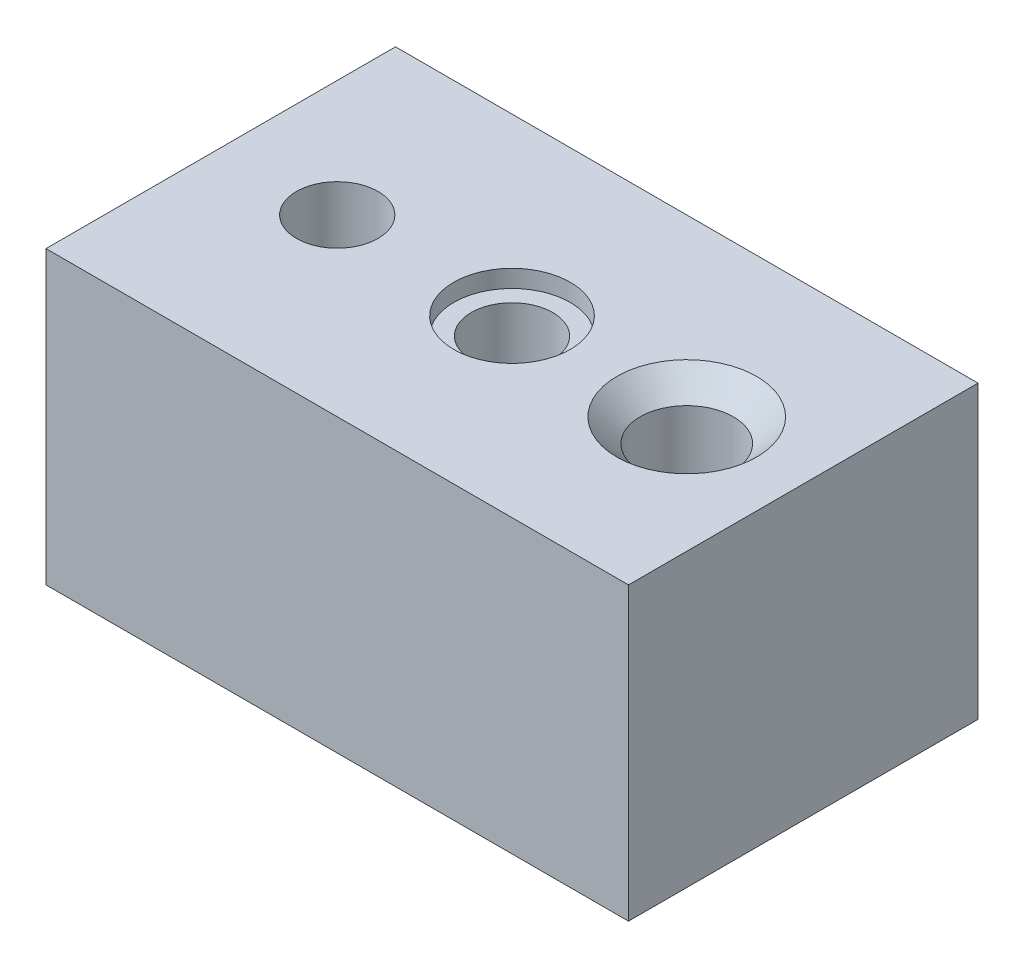
ISO-10303-21;
HEADER;
FILE_DESCRIPTION(('STEP AP214'),'2;1');
FILE_NAME('part.step','',(''),(''),'','','');
FILE_SCHEMA(('AUTOMOTIVE_DESIGN { 1 0 10303 214 1 1 1 1 }'));
ENDSEC;
DATA;
#1=APPLICATION_CONTEXT('core data for automotive mechanical design processes');
#2=APPLICATION_PROTOCOL_DEFINITION('international standard','automotive_design',2000,#1);
#3=PRODUCT_CONTEXT('',#1,'mechanical');
#4=PRODUCT('Part','Part','',(#3));
#5=PRODUCT_RELATED_PRODUCT_CATEGORY('part','',(#4));
#6=PRODUCT_DEFINITION_FORMATION('','',#4);
#7=PRODUCT_DEFINITION_CONTEXT('part definition',#1,'design');
#8=PRODUCT_DEFINITION('design','',#6,#7);
#9=PRODUCT_DEFINITION_SHAPE('','',#8);
#10=(LENGTH_UNIT() NAMED_UNIT(*) SI_UNIT(.MILLI.,.METRE.));
#11=(NAMED_UNIT(*) PLANE_ANGLE_UNIT() SI_UNIT($,.RADIAN.));
#12=(NAMED_UNIT(*) SI_UNIT($,.STERADIAN.) SOLID_ANGLE_UNIT());
#13=UNCERTAINTY_MEASURE_WITH_UNIT(LENGTH_MEASURE(1.E-05),#10,'distance_accuracy_value','');
#14=(GEOMETRIC_REPRESENTATION_CONTEXT(3) GLOBAL_UNCERTAINTY_ASSIGNED_CONTEXT((#13)) GLOBAL_UNIT_ASSIGNED_CONTEXT((#10,
#11,#12)) REPRESENTATION_CONTEXT('',''));
#15=CARTESIAN_POINT('',(0.,0.,0.));
#16=DIRECTION('',(0.,0.,1.));
#17=DIRECTION('',(1.,0.,0.));
#18=AXIS2_PLACEMENT_3D('',#15,#16,#17);
#19=CARTESIAN_POINT('',(0.,50.,0.));
#20=DIRECTION('',(1.,0.,0.));
#21=DIRECTION('',(0.,0.,-1.));
#22=AXIS2_PLACEMENT_3D('',#19,#20,#21);
#23=PLANE('',#22);
#24=DIRECTION('',(0.,0.,1.));
#25=VECTOR('',#24,1.);
#26=CARTESIAN_POINT('',(0.,0.,0.));
#27=LINE('',#26,#25);
#28=CARTESIAN_POINT('',(0.,0.,-60.));
#29=VERTEX_POINT('',#28);
#30=CARTESIAN_POINT('',(0.,0.,0.));
#31=VERTEX_POINT('',#30);
#32=EDGE_CURVE('E143',#29,#31,#27,.T.);
#33=ORIENTED_EDGE('',*,*,#32,.T.);
#34=DIRECTION('',(0.,-1.,0.));
#35=VECTOR('',#34,1.);
#36=CARTESIAN_POINT('',(0.,50.,0.));
#37=LINE('',#36,#35);
#38=CARTESIAN_POINT('',(0.,50.,0.));
#39=VERTEX_POINT('',#38);
#40=EDGE_CURVE('E11',#39,#31,#37,.T.);
#41=ORIENTED_EDGE('',*,*,#40,.F.);
#42=DIRECTION('',(0.,0.,1.));
#43=VECTOR('',#42,1.);
#44=CARTESIAN_POINT('',(0.,50.,0.));
#45=LINE('',#44,#43);
#46=CARTESIAN_POINT('',(0.,50.,-60.));
#47=VERTEX_POINT('',#46);
#48=EDGE_CURVE('E144',#47,#39,#45,.T.);
#49=ORIENTED_EDGE('',*,*,#48,.F.);
#50=DIRECTION('',(0.,-1.,0.));
#51=VECTOR('',#50,1.);
#52=CARTESIAN_POINT('',(0.,50.,-60.));
#53=LINE('',#52,#51);
#54=EDGE_CURVE('E154',#47,#29,#53,.T.);
#55=ORIENTED_EDGE('',*,*,#54,.T.);
#56=EDGE_LOOP('',(#33,#41,#49,#55));
#57=FACE_BOUND('',#56,.T.);
#58=ADVANCED_FACE('F51',(#57),#23,.F.);
#59=CARTESIAN_POINT('',(0.,50.,0.));
#60=DIRECTION('',(0.,0.,-1.));
#61=DIRECTION('',(-1.,0.,0.));
#62=AXIS2_PLACEMENT_3D('',#59,#60,#61);
#63=PLANE('',#62);
#64=DIRECTION('',(1.,0.,0.));
#65=VECTOR('',#64,1.);
#66=CARTESIAN_POINT('',(0.,0.,0.));
#67=LINE('',#66,#65);
#68=CARTESIAN_POINT('',(100.,0.,0.));
#69=VERTEX_POINT('',#68);
#70=EDGE_CURVE('E158',#31,#69,#67,.T.);
#71=ORIENTED_EDGE('',*,*,#70,.T.);
#72=DIRECTION('',(0.,-1.,0.));
#73=VECTOR('',#72,1.);
#74=CARTESIAN_POINT('',(100.,50.,0.));
#75=LINE('',#74,#73);
#76=CARTESIAN_POINT('',(100.,50.,0.));
#77=VERTEX_POINT('',#76);
#78=EDGE_CURVE('E60',#77,#69,#75,.T.);
#79=ORIENTED_EDGE('',*,*,#78,.F.);
#80=DIRECTION('',(1.,0.,0.));
#81=VECTOR('',#80,1.);
#82=CARTESIAN_POINT('',(0.,50.,0.));
#83=LINE('',#82,#81);
#84=EDGE_CURVE('E99',#39,#77,#83,.T.);
#85=ORIENTED_EDGE('',*,*,#84,.F.);
#86=ORIENTED_EDGE('',*,*,#40,.T.);
#87=EDGE_LOOP('',(#71,#79,#85,#86));
#88=FACE_BOUND('',#87,.T.);
#89=ADVANCED_FACE('F190',(#88),#63,.F.);
#90=CARTESIAN_POINT('',(100.,50.,0.));
#91=DIRECTION('',(-1.,0.,0.));
#92=DIRECTION('',(0.,0.,1.));
#93=AXIS2_PLACEMENT_3D('',#90,#91,#92);
#94=PLANE('',#93);
#95=DIRECTION('',(0.,0.,-1.));
#96=VECTOR('',#95,1.);
#97=CARTESIAN_POINT('',(100.,0.,0.));
#98=LINE('',#97,#96);
#99=CARTESIAN_POINT('',(100.,0.,-60.));
#100=VERTEX_POINT('',#99);
#101=EDGE_CURVE('E86',#69,#100,#98,.T.);
#102=ORIENTED_EDGE('',*,*,#101,.T.);
#103=DIRECTION('',(0.,-1.,0.));
#104=VECTOR('',#103,1.);
#105=CARTESIAN_POINT('',(100.,50.,-60.));
#106=LINE('',#105,#104);
#107=CARTESIAN_POINT('',(100.,50.,-60.));
#108=VERTEX_POINT('',#107);
#109=EDGE_CURVE('E167',#108,#100,#106,.T.);
#110=ORIENTED_EDGE('',*,*,#109,.F.);
#111=DIRECTION('',(0.,0.,-1.));
#112=VECTOR('',#111,1.);
#113=CARTESIAN_POINT('',(100.,50.,0.));
#114=LINE('',#113,#112);
#115=EDGE_CURVE('E149',#77,#108,#114,.T.);
#116=ORIENTED_EDGE('',*,*,#115,.F.);
#117=ORIENTED_EDGE('',*,*,#78,.T.);
#118=EDGE_LOOP('',(#102,#110,#116,#117));
#119=FACE_BOUND('',#118,.T.);
#120=ADVANCED_FACE('F173',(#119),#94,.F.);
#121=CARTESIAN_POINT('',(0.,50.,-60.));
#122=DIRECTION('',(0.,0.,1.));
#123=DIRECTION('',(1.,0.,0.));
#124=AXIS2_PLACEMENT_3D('',#121,#122,#123);
#125=PLANE('',#124);
#126=DIRECTION('',(-1.,0.,0.));
#127=VECTOR('',#126,1.);
#128=CARTESIAN_POINT('',(0.,0.,-60.));
#129=LINE('',#128,#127);
#130=EDGE_CURVE('E92',#100,#29,#129,.T.);
#131=ORIENTED_EDGE('',*,*,#130,.T.);
#132=ORIENTED_EDGE('',*,*,#54,.F.);
#133=DIRECTION('',(-1.,0.,0.));
#134=VECTOR('',#133,1.);
#135=CARTESIAN_POINT('',(0.,50.,-60.));
#136=LINE('',#135,#134);
#137=EDGE_CURVE('E68',#108,#47,#136,.T.);
#138=ORIENTED_EDGE('',*,*,#137,.F.);
#139=ORIENTED_EDGE('',*,*,#109,.T.);
#140=EDGE_LOOP('',(#131,#132,#138,#139));
#141=FACE_BOUND('',#140,.T.);
#142=ADVANCED_FACE('F180',(#141),#125,.F.);
#143=CARTESIAN_POINT('',(0.,50.,0.));
#144=DIRECTION('',(0.,-1.,0.));
#145=DIRECTION('',(0.,0.,-1.));
#146=AXIS2_PLACEMENT_3D('',#143,#144,#145);
#147=PLANE('',#146);
#148=CARTESIAN_POINT('',(20.,50.,-30.));
#149=DIRECTION('',(0.,1.,0.));
#150=DIRECTION('',(0.,0.,1.));
#151=AXIS2_PLACEMENT_3D('',#148,#149,#150);
#152=CIRCLE('',#151,7.);
#153=CARTESIAN_POINT('',(20.,50.,-23.));
#154=VERTEX_POINT('',#153);
#155=EDGE_CURVE('E344',#154,#154,#152,.T.);
#156=ORIENTED_EDGE('',*,*,#155,.F.);
#157=EDGE_LOOP('',(#156));
#158=FACE_BOUND('',#157,.T.);
#159=CARTESIAN_POINT('',(80.,50.,-30.));
#160=DIRECTION('',(0.,1.,0.));
#161=DIRECTION('',(0.,0.,1.));
#162=AXIS2_PLACEMENT_3D('',#159,#160,#161);
#163=CIRCLE('',#162,12.);
#164=CARTESIAN_POINT('',(80.,50.,-18.));
#165=VERTEX_POINT('',#164);
#166=EDGE_CURVE('E128',#165,#165,#163,.T.);
#167=ORIENTED_EDGE('',*,*,#166,.F.);
#168=EDGE_LOOP('',(#167));
#169=FACE_BOUND('',#168,.T.);
#170=CARTESIAN_POINT('',(50.,50.,-30.));
#171=DIRECTION('',(0.,1.,0.));
#172=DIRECTION('',(0.,0.,1.));
#173=AXIS2_PLACEMENT_3D('',#170,#171,#172);
#174=CIRCLE('',#173,9.99999999999999);
#175=CARTESIAN_POINT('',(50.,50.,-20.));
#176=VERTEX_POINT('',#175);
#177=EDGE_CURVE('E117',#176,#176,#174,.T.);
#178=ORIENTED_EDGE('',*,*,#177,.F.);
#179=EDGE_LOOP('',(#178));
#180=FACE_BOUND('',#179,.T.);
#181=ORIENTED_EDGE('',*,*,#48,.T.);
#182=ORIENTED_EDGE('',*,*,#84,.T.);
#183=ORIENTED_EDGE('',*,*,#115,.T.);
#184=ORIENTED_EDGE('',*,*,#137,.T.);
#185=EDGE_LOOP('',(#181,#182,#183,#184));
#186=FACE_BOUND('',#185,.T.);
#187=ADVANCED_FACE('F182',(#158,#169,#180,#186),#147,.F.);
#188=CARTESIAN_POINT('',(0.,0.,0.));
#189=DIRECTION('',(0.,-1.,0.));
#190=DIRECTION('',(0.,0.,-1.));
#191=AXIS2_PLACEMENT_3D('',#188,#189,#190);
#192=PLANE('',#191);
#193=CARTESIAN_POINT('',(20.,0.,-30.));
#194=DIRECTION('',(0.,1.,0.));
#195=DIRECTION('',(0.,0.,1.));
#196=AXIS2_PLACEMENT_3D('',#193,#194,#195);
#197=CIRCLE('',#196,6.99999999999999);
#198=CARTESIAN_POINT('',(20.,0.,-23.));
#199=VERTEX_POINT('',#198);
#200=EDGE_CURVE('E341',#199,#199,#197,.T.);
#201=ORIENTED_EDGE('',*,*,#200,.T.);
#202=EDGE_LOOP('',(#201));
#203=FACE_BOUND('',#202,.T.);
#204=ORIENTED_EDGE('',*,*,#32,.F.);
#205=ORIENTED_EDGE('',*,*,#130,.F.);
#206=ORIENTED_EDGE('',*,*,#101,.F.);
#207=ORIENTED_EDGE('',*,*,#70,.F.);
#208=EDGE_LOOP('',(#204,#205,#206,#207));
#209=FACE_BOUND('',#208,.T.);
#210=ADVANCED_FACE('F176',(#203,#209),#192,.T.);
#211=CARTESIAN_POINT('',(50.,34.,-30.));
#212=DIRECTION('',(0.,1.,0.));
#213=DIRECTION('',(0.,0.,1.));
#214=AXIS2_PLACEMENT_3D('',#211,#212,#213);
#215=CONICAL_SURFACE('',#214,6.99999999999999,1.02974425867666);
#216=CARTESIAN_POINT('',(50.,29.7939756668071,-30.));
#217=VERTEX_POINT('',#216);
#218=VERTEX_LOOP('',#217);
#219=FACE_BOUND('',#218,.T.);
#220=CARTESIAN_POINT('',(50.,34.,-30.));
#221=DIRECTION('',(0.,1.,0.));
#222=DIRECTION('',(0.,0.,1.));
#223=AXIS2_PLACEMENT_3D('',#220,#221,#222);
#224=CIRCLE('',#223,6.99999999999999);
#225=CARTESIAN_POINT('',(50.,34.,-23.));
#226=VERTEX_POINT('',#225);
#227=EDGE_CURVE('E139',#226,#226,#224,.T.);
#228=ORIENTED_EDGE('',*,*,#227,.T.);
#229=EDGE_LOOP('',(#228));
#230=FACE_BOUND('',#229,.T.);
#231=ADVANCED_FACE('F224',(#219,#230),#215,.F.);
#232=CARTESIAN_POINT('',(50.,50.,-30.));
#233=DIRECTION('',(0.,1.,0.));
#234=DIRECTION('',(0.,0.,1.));
#235=AXIS2_PLACEMENT_3D('',#232,#233,#234);
#236=CYLINDRICAL_SURFACE('',#235,6.99999999999999);
#237=ORIENTED_EDGE('',*,*,#227,.F.);
#238=EDGE_LOOP('',(#237));
#239=FACE_BOUND('',#238,.T.);
#240=CARTESIAN_POINT('',(50.,47.,-30.));
#241=DIRECTION('',(0.,1.,0.));
#242=DIRECTION('',(0.,0.,1.));
#243=AXIS2_PLACEMENT_3D('',#240,#241,#242);
#244=CIRCLE('',#243,6.99999999999999);
#245=CARTESIAN_POINT('',(50.,47.,-23.));
#246=VERTEX_POINT('',#245);
#247=EDGE_CURVE('E135',#246,#246,#244,.T.);
#248=ORIENTED_EDGE('',*,*,#247,.T.);
#249=EDGE_LOOP('',(#248));
#250=FACE_BOUND('',#249,.T.);
#251=ADVANCED_FACE('F233',(#239,#250),#236,.F.);
#252=CARTESIAN_POINT('',(57.,47.,-30.));
#253=DIRECTION('',(0.,-1.,0.));
#254=DIRECTION('',(0.,0.,-1.));
#255=AXIS2_PLACEMENT_3D('',#252,#253,#254);
#256=PLANE('',#255);
#257=ORIENTED_EDGE('',*,*,#247,.F.);
#258=EDGE_LOOP('',(#257));
#259=FACE_BOUND('',#258,.T.);
#260=CARTESIAN_POINT('',(50.,47.,-30.));
#261=DIRECTION('',(0.,1.,0.));
#262=DIRECTION('',(0.,0.,1.));
#263=AXIS2_PLACEMENT_3D('',#260,#261,#262);
#264=CIRCLE('',#263,9.99999999999999);
#265=CARTESIAN_POINT('',(50.,47.,-20.));
#266=VERTEX_POINT('',#265);
#267=EDGE_CURVE('E125',#266,#266,#264,.T.);
#268=ORIENTED_EDGE('',*,*,#267,.T.);
#269=EDGE_LOOP('',(#268));
#270=FACE_BOUND('',#269,.T.);
#271=ADVANCED_FACE('F243',(#259,#270),#256,.F.);
#272=CARTESIAN_POINT('',(50.,50.,-30.));
#273=DIRECTION('',(0.,1.,0.));
#274=DIRECTION('',(0.,0.,1.));
#275=AXIS2_PLACEMENT_3D('',#272,#273,#274);
#276=CYLINDRICAL_SURFACE('',#275,9.99999999999999);
#277=ORIENTED_EDGE('',*,*,#267,.F.);
#278=EDGE_LOOP('',(#277));
#279=FACE_BOUND('',#278,.T.);
#280=ORIENTED_EDGE('',*,*,#177,.T.);
#281=EDGE_LOOP('',(#280));
#282=FACE_BOUND('',#281,.T.);
#283=ADVANCED_FACE('F110',(#279,#282),#276,.F.);
#284=CARTESIAN_POINT('',(80.,34.,-30.));
#285=DIRECTION('',(0.,1.,0.));
#286=DIRECTION('',(0.,0.,1.));
#287=AXIS2_PLACEMENT_3D('',#284,#285,#286);
#288=CONICAL_SURFACE('',#287,7.99999999999999,1.02974425867665);
#289=CARTESIAN_POINT('',(80.,29.1931150477795,-30.));
#290=VERTEX_POINT('',#289);
#291=VERTEX_LOOP('',#290);
#292=FACE_BOUND('',#291,.T.);
#293=CARTESIAN_POINT('',(80.,34.,-30.));
#294=DIRECTION('',(0.,1.,0.));
#295=DIRECTION('',(0.,0.,1.));
#296=AXIS2_PLACEMENT_3D('',#293,#294,#295);
#297=CIRCLE('',#296,7.99999999999999);
#298=CARTESIAN_POINT('',(80.,34.,-22.));
#299=VERTEX_POINT('',#298);
#300=EDGE_CURVE('E114',#299,#299,#297,.T.);
#301=ORIENTED_EDGE('',*,*,#300,.T.);
#302=EDGE_LOOP('',(#301));
#303=FACE_BOUND('',#302,.T.);
#304=ADVANCED_FACE('F106',(#292,#303),#288,.F.);
#305=CARTESIAN_POINT('',(80.,50.,-30.));
#306=DIRECTION('',(0.,1.,0.));
#307=DIRECTION('',(0.,0.,1.));
#308=AXIS2_PLACEMENT_3D('',#305,#306,#307);
#309=CYLINDRICAL_SURFACE('',#308,7.99999999999999);
#310=ORIENTED_EDGE('',*,*,#300,.F.);
#311=EDGE_LOOP('',(#310));
#312=FACE_BOUND('',#311,.T.);
#313=CARTESIAN_POINT('',(80.,46.,-30.));
#314=DIRECTION('',(0.,1.,0.));
#315=DIRECTION('',(0.,0.,1.));
#316=AXIS2_PLACEMENT_3D('',#313,#314,#315);
#317=CIRCLE('',#316,7.99999999999999);
#318=CARTESIAN_POINT('',(80.,46.,-22.));
#319=VERTEX_POINT('',#318);
#320=EDGE_CURVE('E118',#319,#319,#317,.T.);
#321=ORIENTED_EDGE('',*,*,#320,.T.);
#322=EDGE_LOOP('',(#321));
#323=FACE_BOUND('',#322,.T.);
#324=ADVANCED_FACE('F109',(#312,#323),#309,.F.);
#325=CARTESIAN_POINT('',(80.,50.,-30.));
#326=DIRECTION('',(0.,1.,0.));
#327=DIRECTION('',(0.,0.,1.));
#328=AXIS2_PLACEMENT_3D('',#325,#326,#327);
#329=CONICAL_SURFACE('',#328,12.,0.785398163397448);
#330=ORIENTED_EDGE('',*,*,#320,.F.);
#331=EDGE_LOOP('',(#330));
#332=FACE_BOUND('',#331,.T.);
#333=ORIENTED_EDGE('',*,*,#166,.T.);
#334=EDGE_LOOP('',(#333));
#335=FACE_BOUND('',#334,.T.);
#336=ADVANCED_FACE('F277',(#332,#335),#329,.F.);
#337=CARTESIAN_POINT('',(20.,50.,-30.));
#338=DIRECTION('',(0.,1.,0.));
#339=DIRECTION('',(0.,0.,1.));
#340=AXIS2_PLACEMENT_3D('',#337,#338,#339);
#341=CYLINDRICAL_SURFACE('',#340,6.99999999999999);
#342=ORIENTED_EDGE('',*,*,#200,.F.);
#343=EDGE_LOOP('',(#342));
#344=FACE_BOUND('',#343,.T.);
#345=ORIENTED_EDGE('',*,*,#155,.T.);
#346=EDGE_LOOP('',(#345));
#347=FACE_BOUND('',#346,.T.);
#348=ADVANCED_FACE('F286',(#344,#347),#341,.F.);
#349=CLOSED_SHELL('',(#58,#89,#120,#142,#187,#210,#231,#251,#271,#283,#304,#324,#336,#348));
#350=MANIFOLD_SOLID_BREP('B2',#349);
#351=ADVANCED_BREP_SHAPE_REPRESENTATION('',(#18,#350),#14);
#352=SHAPE_DEFINITION_REPRESENTATION(#9,#351);
ENDSEC;
END-ISO-10303-21;
